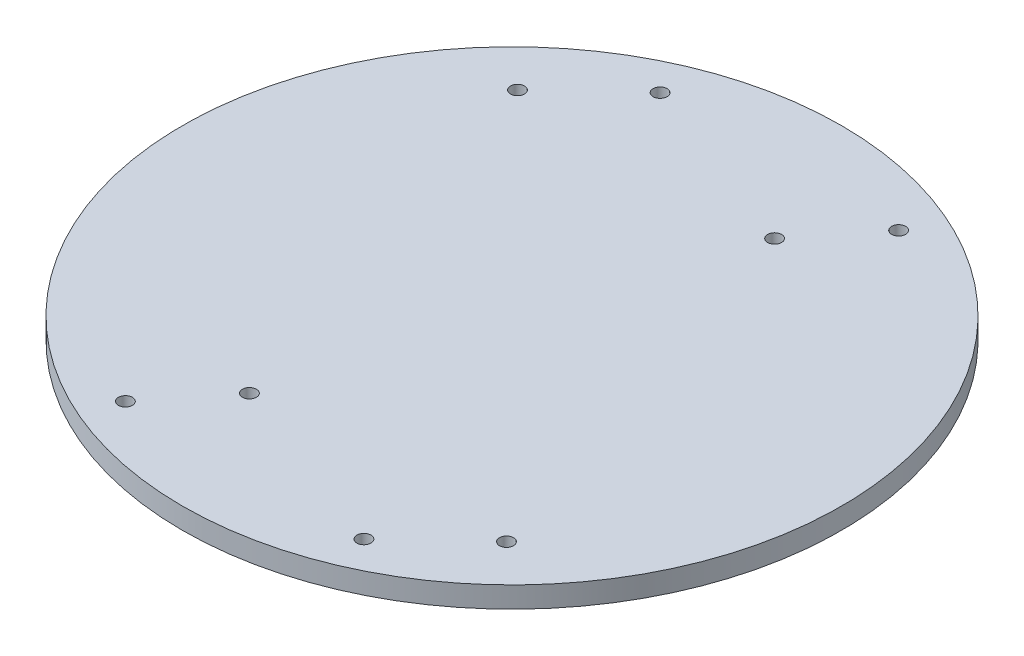
ISO-10303-21;
HEADER;
FILE_DESCRIPTION(('STEP AP214'),'2;1');
FILE_NAME('part.step','',(''),(''),'','','');
FILE_SCHEMA(('AUTOMOTIVE_DESIGN { 1 0 10303 214 1 1 1 1 }'));
ENDSEC;
DATA;
#1=APPLICATION_CONTEXT('core data for automotive mechanical design processes');
#2=APPLICATION_PROTOCOL_DEFINITION('international standard','automotive_design',2000,#1);
#3=PRODUCT_CONTEXT('',#1,'mechanical');
#4=PRODUCT('Part','Part','',(#3));
#5=PRODUCT_RELATED_PRODUCT_CATEGORY('part','',(#4));
#6=PRODUCT_DEFINITION_FORMATION('','',#4);
#7=PRODUCT_DEFINITION_CONTEXT('part definition',#1,'design');
#8=PRODUCT_DEFINITION('design','',#6,#7);
#9=PRODUCT_DEFINITION_SHAPE('','',#8);
#10=(LENGTH_UNIT() NAMED_UNIT(*) SI_UNIT(.MILLI.,.METRE.));
#11=(NAMED_UNIT(*) PLANE_ANGLE_UNIT() SI_UNIT($,.RADIAN.));
#12=(NAMED_UNIT(*) SI_UNIT($,.STERADIAN.) SOLID_ANGLE_UNIT());
#13=UNCERTAINTY_MEASURE_WITH_UNIT(LENGTH_MEASURE(1.E-05),#10,'distance_accuracy_value','');
#14=(GEOMETRIC_REPRESENTATION_CONTEXT(3) GLOBAL_UNCERTAINTY_ASSIGNED_CONTEXT((#13)) GLOBAL_UNIT_ASSIGNED_CONTEXT((#10,
#11,#12)) REPRESENTATION_CONTEXT('',''));
#15=CARTESIAN_POINT('',(0.,0.,0.));
#16=DIRECTION('',(0.,0.,1.));
#17=DIRECTION('',(1.,0.,0.));
#18=AXIS2_PLACEMENT_3D('',#15,#16,#17);
#19=CARTESIAN_POINT('',(0.,1.5,0.));
#20=DIRECTION('',(0.,-1.,0.));
#21=DIRECTION('',(0.,0.,-1.));
#22=AXIS2_PLACEMENT_3D('',#19,#20,#21);
#23=CYLINDRICAL_SURFACE('',#22,47.);
#24=CARTESIAN_POINT('',(0.,1.5,0.));
#25=DIRECTION('',(0.,1.,0.));
#26=DIRECTION('',(0.,0.,1.));
#27=AXIS2_PLACEMENT_3D('',#24,#25,#26);
#28=CIRCLE('',#27,47.);
#29=CARTESIAN_POINT('',(0.,1.5,47.));
#30=VERTEX_POINT('',#29);
#31=EDGE_CURVE('E10',#30,#30,#28,.T.);
#32=ORIENTED_EDGE('',*,*,#31,.F.);
#33=EDGE_LOOP('',(#32));
#34=FACE_BOUND('',#33,.T.);
#35=CARTESIAN_POINT('',(0.,-1.5,0.));
#36=DIRECTION('',(0.,1.,0.));
#37=DIRECTION('',(0.,0.,1.));
#38=AXIS2_PLACEMENT_3D('',#35,#36,#37);
#39=CIRCLE('',#38,47.);
#40=CARTESIAN_POINT('',(0.,-1.5,47.));
#41=VERTEX_POINT('',#40);
#42=EDGE_CURVE('E33',#41,#41,#39,.T.);
#43=ORIENTED_EDGE('',*,*,#42,.T.);
#44=EDGE_LOOP('',(#43));
#45=FACE_BOUND('',#44,.T.);
#46=ADVANCED_FACE('F30',(#34,#45),#23,.T.);
#47=CARTESIAN_POINT('',(0.,1.5,0.));
#48=DIRECTION('',(0.,1.,0.));
#49=DIRECTION('',(0.,0.,1.));
#50=AXIS2_PLACEMENT_3D('',#47,#48,#49);
#51=PLANE('',#50);
#52=CARTESIAN_POINT('',(-17.0092592584861,1.5,38.1280421668568));
#53=DIRECTION('',(0.,1.,0.));
#54=DIRECTION('',(0.,0.,-1.));
#55=AXIS2_PLACEMENT_3D('',#52,#53,#54);
#56=CIRCLE('',#55,1.);
#57=CARTESIAN_POINT('',(-17.0092592584861,1.5,37.1280421668568));
#58=VERTEX_POINT('',#57);
#59=EDGE_CURVE('E84',#58,#58,#56,.T.);
#60=ORIENTED_EDGE('',*,*,#59,.F.);
#61=EDGE_LOOP('',(#60));
#62=FACE_BOUND('',#61,.T.);
#63=CARTESIAN_POINT('',(-17.009259258486,1.5,-38.1280421668568));
#64=DIRECTION('',(0.,1.,0.));
#65=DIRECTION('',(0.,0.,1.));
#66=AXIS2_PLACEMENT_3D('',#63,#64,#65);
#67=CIRCLE('',#66,1.);
#68=CARTESIAN_POINT('',(-17.009259258486,1.5,-37.1280421668568));
#69=VERTEX_POINT('',#68);
#70=EDGE_CURVE('E78',#69,#69,#67,.T.);
#71=ORIENTED_EDGE('',*,*,#70,.F.);
#72=EDGE_LOOP('',(#71));
#73=FACE_BOUND('',#72,.T.);
#74=CARTESIAN_POINT('',(17.009259258486,1.5,-38.1280421668568));
#75=DIRECTION('',(0.,1.,0.));
#76=DIRECTION('',(0.,0.,-1.));
#77=AXIS2_PLACEMENT_3D('',#74,#75,#76);
#78=CIRCLE('',#77,1.);
#79=CARTESIAN_POINT('',(17.009259258486,1.5,-39.1280421668568));
#80=VERTEX_POINT('',#79);
#81=EDGE_CURVE('E72',#80,#80,#78,.T.);
#82=ORIENTED_EDGE('',*,*,#81,.F.);
#83=EDGE_LOOP('',(#82));
#84=FACE_BOUND('',#83,.T.);
#85=CARTESIAN_POINT('',(17.0092592584861,1.5,38.1280421668568));
#86=DIRECTION('',(0.,1.,0.));
#87=DIRECTION('',(0.,0.,1.));
#88=AXIS2_PLACEMENT_3D('',#85,#86,#87);
#89=CIRCLE('',#88,1.);
#90=CARTESIAN_POINT('',(17.0092592584861,1.5,39.1280421668568));
#91=VERTEX_POINT('',#90);
#92=EDGE_CURVE('E66',#91,#91,#89,.T.);
#93=ORIENTED_EDGE('',*,*,#92,.F.);
#94=EDGE_LOOP('',(#93));
#95=FACE_BOUND('',#94,.T.);
#96=CARTESIAN_POINT('',(-27.4999999999999,1.5,-28.2842712474619));
#97=DIRECTION('',(0.,1.,0.));
#98=DIRECTION('',(0.,0.,1.));
#99=AXIS2_PLACEMENT_3D('',#96,#97,#98);
#100=CIRCLE('',#99,1.);
#101=CARTESIAN_POINT('',(-27.4999999999999,1.5,-27.2842712474619));
#102=VERTEX_POINT('',#101);
#103=EDGE_CURVE('E60',#102,#102,#100,.T.);
#104=ORIENTED_EDGE('',*,*,#103,.F.);
#105=EDGE_LOOP('',(#104));
#106=FACE_BOUND('',#105,.T.);
#107=CARTESIAN_POINT('',(-9.16666666499999,1.5,28.2842712474619));
#108=DIRECTION('',(0.,1.,0.));
#109=DIRECTION('',(0.,0.,1.));
#110=AXIS2_PLACEMENT_3D('',#107,#108,#109);
#111=CIRCLE('',#110,1.);
#112=CARTESIAN_POINT('',(-9.16666666499999,1.5,29.2842712474619));
#113=VERTEX_POINT('',#112);
#114=EDGE_CURVE('E54',#113,#113,#111,.T.);
#115=ORIENTED_EDGE('',*,*,#114,.F.);
#116=EDGE_LOOP('',(#115));
#117=FACE_BOUND('',#116,.T.);
#118=CARTESIAN_POINT('',(9.16666666499999,1.5,-28.2842712474619));
#119=DIRECTION('',(0.,1.,0.));
#120=DIRECTION('',(0.,0.,1.));
#121=AXIS2_PLACEMENT_3D('',#118,#119,#120);
#122=CIRCLE('',#121,1.);
#123=CARTESIAN_POINT('',(9.16666666499999,1.5,-27.2842712474619));
#124=VERTEX_POINT('',#123);
#125=EDGE_CURVE('E48',#124,#124,#122,.T.);
#126=ORIENTED_EDGE('',*,*,#125,.F.);
#127=EDGE_LOOP('',(#126));
#128=FACE_BOUND('',#127,.T.);
#129=CARTESIAN_POINT('',(27.4999999999999,1.5,28.2842712474619));
#130=DIRECTION('',(0.,1.,0.));
#131=DIRECTION('',(0.,0.,1.));
#132=AXIS2_PLACEMENT_3D('',#129,#130,#131);
#133=CIRCLE('',#132,0.999999999999987);
#134=CARTESIAN_POINT('',(27.4999999999999,1.5,29.2842712474619));
#135=VERTEX_POINT('',#134);
#136=EDGE_CURVE('E42',#135,#135,#133,.T.);
#137=ORIENTED_EDGE('',*,*,#136,.F.);
#138=EDGE_LOOP('',(#137));
#139=FACE_BOUND('',#138,.T.);
#140=ORIENTED_EDGE('',*,*,#31,.T.);
#141=EDGE_LOOP('',(#140));
#142=FACE_BOUND('',#141,.T.);
#143=ADVANCED_FACE('F100',(#62,#73,#84,#95,#106,#117,#128,#139,#142),#51,.T.);
#144=CARTESIAN_POINT('',(0.,-1.5,0.));
#145=DIRECTION('',(0.,1.,0.));
#146=DIRECTION('',(0.,0.,1.));
#147=AXIS2_PLACEMENT_3D('',#144,#145,#146);
#148=PLANE('',#147);
#149=CARTESIAN_POINT('',(-17.0092592584861,-1.5,38.1280421668568));
#150=DIRECTION('',(0.,1.,0.));
#151=DIRECTION('',(0.,0.,-1.));
#152=AXIS2_PLACEMENT_3D('',#149,#150,#151);
#153=CIRCLE('',#152,1.);
#154=CARTESIAN_POINT('',(-17.0092592584861,-1.5,37.1280421668568));
#155=VERTEX_POINT('',#154);
#156=EDGE_CURVE('E81',#155,#155,#153,.T.);
#157=ORIENTED_EDGE('',*,*,#156,.T.);
#158=EDGE_LOOP('',(#157));
#159=FACE_BOUND('',#158,.T.);
#160=CARTESIAN_POINT('',(-17.009259258486,-1.5,-38.1280421668568));
#161=DIRECTION('',(0.,1.,0.));
#162=DIRECTION('',(0.,0.,1.));
#163=AXIS2_PLACEMENT_3D('',#160,#161,#162);
#164=CIRCLE('',#163,1.);
#165=CARTESIAN_POINT('',(-17.009259258486,-1.5,-37.1280421668568));
#166=VERTEX_POINT('',#165);
#167=EDGE_CURVE('E75',#166,#166,#164,.T.);
#168=ORIENTED_EDGE('',*,*,#167,.T.);
#169=EDGE_LOOP('',(#168));
#170=FACE_BOUND('',#169,.T.);
#171=CARTESIAN_POINT('',(17.009259258486,-1.5,-38.1280421668568));
#172=DIRECTION('',(0.,1.,0.));
#173=DIRECTION('',(0.,0.,-1.));
#174=AXIS2_PLACEMENT_3D('',#171,#172,#173);
#175=CIRCLE('',#174,1.);
#176=CARTESIAN_POINT('',(17.009259258486,-1.5,-39.1280421668568));
#177=VERTEX_POINT('',#176);
#178=EDGE_CURVE('E69',#177,#177,#175,.T.);
#179=ORIENTED_EDGE('',*,*,#178,.T.);
#180=EDGE_LOOP('',(#179));
#181=FACE_BOUND('',#180,.T.);
#182=CARTESIAN_POINT('',(17.0092592584861,-1.5,38.1280421668568));
#183=DIRECTION('',(0.,1.,0.));
#184=DIRECTION('',(0.,0.,1.));
#185=AXIS2_PLACEMENT_3D('',#182,#183,#184);
#186=CIRCLE('',#185,1.);
#187=CARTESIAN_POINT('',(17.0092592584861,-1.5,39.1280421668568));
#188=VERTEX_POINT('',#187);
#189=EDGE_CURVE('E63',#188,#188,#186,.T.);
#190=ORIENTED_EDGE('',*,*,#189,.T.);
#191=EDGE_LOOP('',(#190));
#192=FACE_BOUND('',#191,.T.);
#193=CARTESIAN_POINT('',(-27.4999999999999,-1.5,-28.2842712474619));
#194=DIRECTION('',(0.,1.,0.));
#195=DIRECTION('',(0.,0.,1.));
#196=AXIS2_PLACEMENT_3D('',#193,#194,#195);
#197=CIRCLE('',#196,1.);
#198=CARTESIAN_POINT('',(-27.4999999999999,-1.5,-27.2842712474619));
#199=VERTEX_POINT('',#198);
#200=EDGE_CURVE('E57',#199,#199,#197,.T.);
#201=ORIENTED_EDGE('',*,*,#200,.T.);
#202=EDGE_LOOP('',(#201));
#203=FACE_BOUND('',#202,.T.);
#204=CARTESIAN_POINT('',(-9.16666666499999,-1.5,28.2842712474619));
#205=DIRECTION('',(0.,1.,0.));
#206=DIRECTION('',(0.,0.,1.));
#207=AXIS2_PLACEMENT_3D('',#204,#205,#206);
#208=CIRCLE('',#207,1.);
#209=CARTESIAN_POINT('',(-9.16666666499999,-1.5,29.2842712474619));
#210=VERTEX_POINT('',#209);
#211=EDGE_CURVE('E51',#210,#210,#208,.T.);
#212=ORIENTED_EDGE('',*,*,#211,.T.);
#213=EDGE_LOOP('',(#212));
#214=FACE_BOUND('',#213,.T.);
#215=CARTESIAN_POINT('',(9.16666666499999,-1.5,-28.2842712474619));
#216=DIRECTION('',(0.,1.,0.));
#217=DIRECTION('',(0.,0.,1.));
#218=AXIS2_PLACEMENT_3D('',#215,#216,#217);
#219=CIRCLE('',#218,1.);
#220=CARTESIAN_POINT('',(9.16666666499999,-1.5,-27.2842712474619));
#221=VERTEX_POINT('',#220);
#222=EDGE_CURVE('E45',#221,#221,#219,.T.);
#223=ORIENTED_EDGE('',*,*,#222,.T.);
#224=EDGE_LOOP('',(#223));
#225=FACE_BOUND('',#224,.T.);
#226=CARTESIAN_POINT('',(27.4999999999999,-1.5,28.2842712474619));
#227=DIRECTION('',(0.,1.,0.));
#228=DIRECTION('',(0.,0.,1.));
#229=AXIS2_PLACEMENT_3D('',#226,#227,#228);
#230=CIRCLE('',#229,0.999999999999987);
#231=CARTESIAN_POINT('',(27.4999999999999,-1.5,29.2842712474619));
#232=VERTEX_POINT('',#231);
#233=EDGE_CURVE('E40',#232,#232,#230,.T.);
#234=ORIENTED_EDGE('',*,*,#233,.T.);
#235=EDGE_LOOP('',(#234));
#236=FACE_BOUND('',#235,.T.);
#237=ORIENTED_EDGE('',*,*,#42,.F.);
#238=EDGE_LOOP('',(#237));
#239=FACE_BOUND('',#238,.T.);
#240=ADVANCED_FACE('F90',(#159,#170,#181,#192,#203,#214,#225,#236,#239),#148,.F.);
#241=CARTESIAN_POINT('',(27.4999999999999,-1.5,28.2842712474619));
#242=DIRECTION('',(0.,1.,0.));
#243=DIRECTION('',(0.,0.,1.));
#244=AXIS2_PLACEMENT_3D('',#241,#242,#243);
#245=CYLINDRICAL_SURFACE('',#244,0.999999999999987);
#246=ORIENTED_EDGE('',*,*,#233,.F.);
#247=EDGE_LOOP('',(#246));
#248=FACE_BOUND('',#247,.T.);
#249=ORIENTED_EDGE('',*,*,#136,.T.);
#250=EDGE_LOOP('',(#249));
#251=FACE_BOUND('',#250,.T.);
#252=ADVANCED_FACE('F118',(#248,#251),#245,.F.);
#253=CARTESIAN_POINT('',(9.16666666499999,-1.5,-28.2842712474619));
#254=DIRECTION('',(0.,1.,0.));
#255=DIRECTION('',(0.,0.,1.));
#256=AXIS2_PLACEMENT_3D('',#253,#254,#255);
#257=CYLINDRICAL_SURFACE('',#256,1.);
#258=ORIENTED_EDGE('',*,*,#222,.F.);
#259=EDGE_LOOP('',(#258));
#260=FACE_BOUND('',#259,.T.);
#261=ORIENTED_EDGE('',*,*,#125,.T.);
#262=EDGE_LOOP('',(#261));
#263=FACE_BOUND('',#262,.T.);
#264=ADVANCED_FACE('F120',(#260,#263),#257,.F.);
#265=CARTESIAN_POINT('',(-9.16666666499999,-1.5,28.2842712474619));
#266=DIRECTION('',(0.,1.,0.));
#267=DIRECTION('',(0.,0.,1.));
#268=AXIS2_PLACEMENT_3D('',#265,#266,#267);
#269=CYLINDRICAL_SURFACE('',#268,1.);
#270=ORIENTED_EDGE('',*,*,#211,.F.);
#271=EDGE_LOOP('',(#270));
#272=FACE_BOUND('',#271,.T.);
#273=ORIENTED_EDGE('',*,*,#114,.T.);
#274=EDGE_LOOP('',(#273));
#275=FACE_BOUND('',#274,.T.);
#276=ADVANCED_FACE('F127',(#272,#275),#269,.F.);
#277=CARTESIAN_POINT('',(-27.4999999999999,-1.5,-28.2842712474619));
#278=DIRECTION('',(0.,1.,0.));
#279=DIRECTION('',(0.,0.,1.));
#280=AXIS2_PLACEMENT_3D('',#277,#278,#279);
#281=CYLINDRICAL_SURFACE('',#280,1.);
#282=ORIENTED_EDGE('',*,*,#200,.F.);
#283=EDGE_LOOP('',(#282));
#284=FACE_BOUND('',#283,.T.);
#285=ORIENTED_EDGE('',*,*,#103,.T.);
#286=EDGE_LOOP('',(#285));
#287=FACE_BOUND('',#286,.T.);
#288=ADVANCED_FACE('F165',(#284,#287),#281,.F.);
#289=CARTESIAN_POINT('',(17.0092592584861,-1.5,38.1280421668568));
#290=DIRECTION('',(0.,1.,0.));
#291=DIRECTION('',(0.,0.,1.));
#292=AXIS2_PLACEMENT_3D('',#289,#290,#291);
#293=CYLINDRICAL_SURFACE('',#292,1.);
#294=ORIENTED_EDGE('',*,*,#189,.F.);
#295=EDGE_LOOP('',(#294));
#296=FACE_BOUND('',#295,.T.);
#297=ORIENTED_EDGE('',*,*,#92,.T.);
#298=EDGE_LOOP('',(#297));
#299=FACE_BOUND('',#298,.T.);
#300=ADVANCED_FACE('F175',(#296,#299),#293,.F.);
#301=CARTESIAN_POINT('',(17.009259258486,-1.5,-38.1280421668568));
#302=DIRECTION('',(0.,1.,0.));
#303=DIRECTION('',(0.,0.,1.));
#304=AXIS2_PLACEMENT_3D('',#301,#302,#303);
#305=CYLINDRICAL_SURFACE('',#304,1.);
#306=ORIENTED_EDGE('',*,*,#178,.F.);
#307=EDGE_LOOP('',(#306));
#308=FACE_BOUND('',#307,.T.);
#309=ORIENTED_EDGE('',*,*,#81,.T.);
#310=EDGE_LOOP('',(#309));
#311=FACE_BOUND('',#310,.T.);
#312=ADVANCED_FACE('F185',(#308,#311),#305,.F.);
#313=CARTESIAN_POINT('',(-17.009259258486,-1.5,-38.1280421668568));
#314=DIRECTION('',(0.,1.,0.));
#315=DIRECTION('',(0.,0.,1.));
#316=AXIS2_PLACEMENT_3D('',#313,#314,#315);
#317=CYLINDRICAL_SURFACE('',#316,1.);
#318=ORIENTED_EDGE('',*,*,#167,.F.);
#319=EDGE_LOOP('',(#318));
#320=FACE_BOUND('',#319,.T.);
#321=ORIENTED_EDGE('',*,*,#70,.T.);
#322=EDGE_LOOP('',(#321));
#323=FACE_BOUND('',#322,.T.);
#324=ADVANCED_FACE('F96',(#320,#323),#317,.F.);
#325=CARTESIAN_POINT('',(-17.0092592584861,-1.5,38.1280421668568));
#326=DIRECTION('',(0.,1.,0.));
#327=DIRECTION('',(0.,0.,1.));
#328=AXIS2_PLACEMENT_3D('',#325,#326,#327);
#329=CYLINDRICAL_SURFACE('',#328,1.);
#330=ORIENTED_EDGE('',*,*,#156,.F.);
#331=EDGE_LOOP('',(#330));
#332=FACE_BOUND('',#331,.T.);
#333=ORIENTED_EDGE('',*,*,#59,.T.);
#334=EDGE_LOOP('',(#333));
#335=FACE_BOUND('',#334,.T.);
#336=ADVANCED_FACE('F93',(#332,#335),#329,.F.);
#337=CLOSED_SHELL('',(#46,#143,#240,#252,#264,#276,#288,#300,#312,#324,#336));
#338=MANIFOLD_SOLID_BREP('B2',#337);
#339=ADVANCED_BREP_SHAPE_REPRESENTATION('',(#18,#338),#14);
#340=SHAPE_DEFINITION_REPRESENTATION(#9,#339);
ENDSEC;
END-ISO-10303-21;
